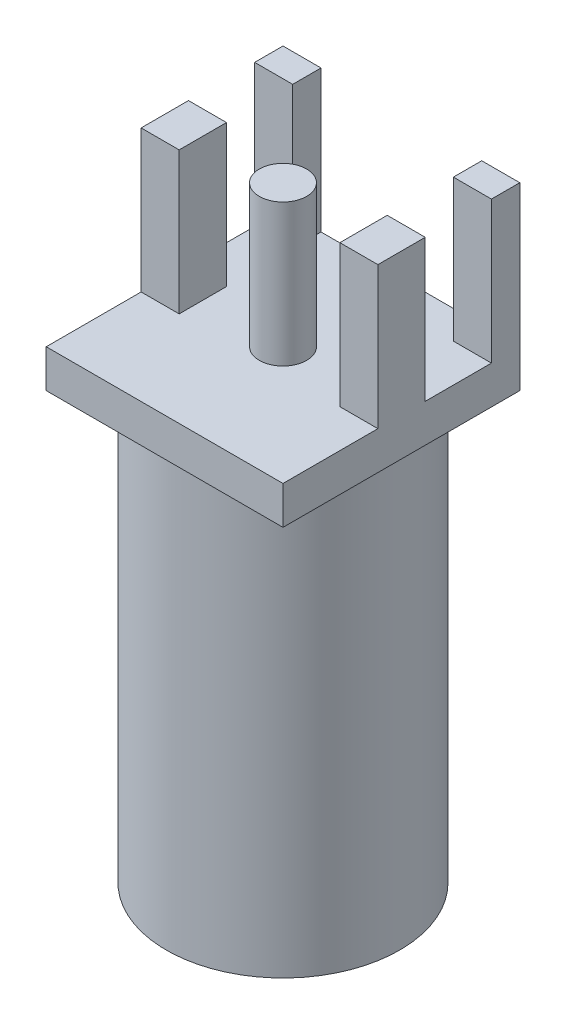
ISO-10303-21;
HEADER;
FILE_DESCRIPTION(('STEP AP214'),'2;1');
FILE_NAME('part.step','',(''),(''),'','','');
FILE_SCHEMA(('AUTOMOTIVE_DESIGN { 1 0 10303 214 1 1 1 1 }'));
ENDSEC;
DATA;
#1=APPLICATION_CONTEXT('core data for automotive mechanical design processes');
#2=APPLICATION_PROTOCOL_DEFINITION('international standard','automotive_design',2000,#1);
#3=PRODUCT_CONTEXT('',#1,'mechanical');
#4=PRODUCT('Part','Part','',(#3));
#5=PRODUCT_RELATED_PRODUCT_CATEGORY('part','',(#4));
#6=PRODUCT_DEFINITION_FORMATION('','',#4);
#7=PRODUCT_DEFINITION_CONTEXT('part definition',#1,'design');
#8=PRODUCT_DEFINITION('design','',#6,#7);
#9=PRODUCT_DEFINITION_SHAPE('','',#8);
#10=(LENGTH_UNIT() NAMED_UNIT(*) SI_UNIT(.MILLI.,.METRE.));
#11=(NAMED_UNIT(*) PLANE_ANGLE_UNIT() SI_UNIT($,.RADIAN.));
#12=(NAMED_UNIT(*) SI_UNIT($,.STERADIAN.) SOLID_ANGLE_UNIT());
#13=UNCERTAINTY_MEASURE_WITH_UNIT(LENGTH_MEASURE(1.E-05),#10,'distance_accuracy_value','');
#14=(GEOMETRIC_REPRESENTATION_CONTEXT(3) GLOBAL_UNCERTAINTY_ASSIGNED_CONTEXT((#13)) GLOBAL_UNIT_ASSIGNED_CONTEXT((#10,
#11,#12)) REPRESENTATION_CONTEXT('',''));
#15=CARTESIAN_POINT('',(0.,0.,0.));
#16=DIRECTION('',(0.,0.,1.));
#17=DIRECTION('',(1.,0.,0.));
#18=AXIS2_PLACEMENT_3D('',#15,#16,#17);
#19=CARTESIAN_POINT('',(0.,1.02,0.));
#20=DIRECTION('',(0.,1.,0.));
#21=DIRECTION('',(0.,0.,1.));
#22=AXIS2_PLACEMENT_3D('',#19,#20,#21);
#23=PLANE('',#22);
#24=CARTESIAN_POINT('',(0.,1.02,0.));
#25=DIRECTION('',(0.,1.,0.));
#26=DIRECTION('',(0.,0.,1.));
#27=AXIS2_PLACEMENT_3D('',#24,#25,#26);
#28=CIRCLE('',#27,0.635);
#29=CARTESIAN_POINT('',(0.,1.02,0.635));
#30=VERTEX_POINT('',#29);
#31=EDGE_CURVE('E538',#30,#30,#28,.T.);
#32=ORIENTED_EDGE('',*,*,#31,.F.);
#33=EDGE_LOOP('',(#32));
#34=FACE_BOUND('',#33,.T.);
#35=DIRECTION('',(1.,0.,0.));
#36=VECTOR('',#35,1.);
#37=CARTESIAN_POINT('',(3.175,1.02,-2.415));
#38=LINE('',#37,#36);
#39=CARTESIAN_POINT('',(2.155,1.02,-2.415));
#40=VERTEX_POINT('',#39);
#41=CARTESIAN_POINT('',(3.175,1.02,-2.415));
#42=VERTEX_POINT('',#41);
#43=EDGE_CURVE('E49',#40,#42,#38,.T.);
#44=ORIENTED_EDGE('',*,*,#43,.F.);
#45=DIRECTION('',(0.,0.,1.));
#46=VECTOR('',#45,1.);
#47=CARTESIAN_POINT('',(2.155,1.02,-3.175));
#48=LINE('',#47,#46);
#49=CARTESIAN_POINT('',(2.155,1.02,-3.175));
#50=VERTEX_POINT('',#49);
#51=EDGE_CURVE('E545',#50,#40,#48,.T.);
#52=ORIENTED_EDGE('',*,*,#51,.F.);
#53=DIRECTION('',(-1.,0.,0.));
#54=VECTOR('',#53,1.);
#55=CARTESIAN_POINT('',(-3.175,1.02,-3.175));
#56=LINE('',#55,#54);
#57=CARTESIAN_POINT('',(-2.155,1.02,-3.175));
#58=VERTEX_POINT('',#57);
#59=EDGE_CURVE('E180',#50,#58,#56,.T.);
#60=ORIENTED_EDGE('',*,*,#59,.T.);
#61=DIRECTION('',(0.,0.,-1.));
#62=VECTOR('',#61,1.);
#63=CARTESIAN_POINT('',(-2.155,1.02,-3.175));
#64=LINE('',#63,#62);
#65=CARTESIAN_POINT('',(-2.155,1.02,-2.415));
#66=VERTEX_POINT('',#65);
#67=EDGE_CURVE('E247',#66,#58,#64,.T.);
#68=ORIENTED_EDGE('',*,*,#67,.F.);
#69=DIRECTION('',(1.,0.,0.));
#70=VECTOR('',#69,1.);
#71=CARTESIAN_POINT('',(-3.175,1.02,-2.415));
#72=LINE('',#71,#70);
#73=CARTESIAN_POINT('',(-3.175,1.02,-2.415));
#74=VERTEX_POINT('',#73);
#75=EDGE_CURVE('E242',#74,#66,#72,.T.);
#76=ORIENTED_EDGE('',*,*,#75,.F.);
#77=DIRECTION('',(0.,0.,1.));
#78=VECTOR('',#77,1.);
#79=CARTESIAN_POINT('',(-3.175,1.02,-3.175));
#80=LINE('',#79,#78);
#81=CARTESIAN_POINT('',(-3.175,1.02,-0.64));
#82=VERTEX_POINT('',#81);
#83=EDGE_CURVE('E271',#74,#82,#80,.T.);
#84=ORIENTED_EDGE('',*,*,#83,.T.);
#85=DIRECTION('',(-1.,0.,0.));
#86=VECTOR('',#85,1.);
#87=CARTESIAN_POINT('',(-3.175,1.02,-0.64));
#88=LINE('',#87,#86);
#89=CARTESIAN_POINT('',(-2.155,1.02,-0.64));
#90=VERTEX_POINT('',#89);
#91=EDGE_CURVE('E221',#90,#82,#88,.T.);
#92=ORIENTED_EDGE('',*,*,#91,.F.);
#93=DIRECTION('',(0.,0.,-1.));
#94=VECTOR('',#93,1.);
#95=CARTESIAN_POINT('',(-2.155,1.02,-0.64));
#96=LINE('',#95,#94);
#97=CARTESIAN_POINT('',(-2.155,1.02,0.63));
#98=VERTEX_POINT('',#97);
#99=EDGE_CURVE('E229',#98,#90,#96,.T.);
#100=ORIENTED_EDGE('',*,*,#99,.F.);
#101=DIRECTION('',(1.,0.,0.));
#102=VECTOR('',#101,1.);
#103=CARTESIAN_POINT('',(-3.175,1.02,0.63));
#104=LINE('',#103,#102);
#105=CARTESIAN_POINT('',(-3.175,1.02,0.63));
#106=VERTEX_POINT('',#105);
#107=EDGE_CURVE('E216',#106,#98,#104,.T.);
#108=ORIENTED_EDGE('',*,*,#107,.F.);
#109=CARTESIAN_POINT('',(-3.175,1.02,3.175));
#110=VERTEX_POINT('',#109);
#111=EDGE_CURVE('E270',#106,#110,#80,.T.);
#112=ORIENTED_EDGE('',*,*,#111,.T.);
#113=DIRECTION('',(1.,0.,0.));
#114=VECTOR('',#113,1.);
#115=CARTESIAN_POINT('',(-3.175,1.02,3.175));
#116=LINE('',#115,#114);
#117=CARTESIAN_POINT('',(3.175,1.02,3.175));
#118=VERTEX_POINT('',#117);
#119=EDGE_CURVE('E274',#110,#118,#116,.T.);
#120=ORIENTED_EDGE('',*,*,#119,.T.);
#121=DIRECTION('',(0.,0.,-1.));
#122=VECTOR('',#121,1.);
#123=CARTESIAN_POINT('',(3.175,1.02,-3.175));
#124=LINE('',#123,#122);
#125=CARTESIAN_POINT('',(3.175,1.02,0.63));
#126=VERTEX_POINT('',#125);
#127=EDGE_CURVE('E267',#118,#126,#124,.T.);
#128=ORIENTED_EDGE('',*,*,#127,.T.);
#129=DIRECTION('',(1.,0.,0.));
#130=VECTOR('',#129,1.);
#131=CARTESIAN_POINT('',(3.175,1.02,0.63));
#132=LINE('',#131,#130);
#133=CARTESIAN_POINT('',(2.155,1.02,0.63));
#134=VERTEX_POINT('',#133);
#135=EDGE_CURVE('E194',#134,#126,#132,.T.);
#136=ORIENTED_EDGE('',*,*,#135,.F.);
#137=DIRECTION('',(0.,0.,1.));
#138=VECTOR('',#137,1.);
#139=CARTESIAN_POINT('',(2.155,1.02,-0.64));
#140=LINE('',#139,#138);
#141=CARTESIAN_POINT('',(2.155,1.02,-0.64));
#142=VERTEX_POINT('',#141);
#143=EDGE_CURVE('E184',#142,#134,#140,.T.);
#144=ORIENTED_EDGE('',*,*,#143,.F.);
#145=DIRECTION('',(-1.,0.,0.));
#146=VECTOR('',#145,1.);
#147=CARTESIAN_POINT('',(3.175,1.02,-0.639999999999999));
#148=LINE('',#147,#146);
#149=CARTESIAN_POINT('',(3.175,1.02,-0.639999999999999));
#150=VERTEX_POINT('',#149);
#151=EDGE_CURVE('E181',#150,#142,#148,.T.);
#152=ORIENTED_EDGE('',*,*,#151,.F.);
#153=EDGE_CURVE('E54',#150,#42,#124,.T.);
#154=ORIENTED_EDGE('',*,*,#153,.T.);
#155=EDGE_LOOP('',(#44,#52,#60,#68,#76,#84,#92,#100,#108,#112,#120,#128,#136,#144,#152,#154));
#156=FACE_BOUND('',#155,.T.);
#157=ADVANCED_FACE('F33',(#34,#156),#23,.T.);
#158=CARTESIAN_POINT('',(3.175,1.02,-3.175));
#159=DIRECTION('',(-1.,0.,0.));
#160=DIRECTION('',(0.,0.,1.));
#161=AXIS2_PLACEMENT_3D('',#158,#159,#160);
#162=PLANE('',#161);
#163=DIRECTION('',(0.,0.,-1.));
#164=VECTOR('',#163,1.);
#165=CARTESIAN_POINT('',(3.175,0.,-3.175));
#166=LINE('',#165,#164);
#167=CARTESIAN_POINT('',(3.175,0.,3.175));
#168=VERTEX_POINT('',#167);
#169=CARTESIAN_POINT('',(3.175,0.,-3.175));
#170=VERTEX_POINT('',#169);
#171=EDGE_CURVE('E266',#168,#170,#166,.T.);
#172=ORIENTED_EDGE('',*,*,#171,.T.);
#173=DIRECTION('',(0.,-1.,0.));
#174=VECTOR('',#173,1.);
#175=CARTESIAN_POINT('',(3.175,1.02,-3.175));
#176=LINE('',#175,#174);
#177=CARTESIAN_POINT('',(3.175,4.83,-3.175));
#178=VERTEX_POINT('',#177);
#179=EDGE_CURVE('E37',#178,#170,#176,.T.);
#180=ORIENTED_EDGE('',*,*,#179,.F.);
#181=DIRECTION('',(0.,0.,-1.));
#182=VECTOR('',#181,1.);
#183=CARTESIAN_POINT('',(3.175,4.83,-3.175));
#184=LINE('',#183,#182);
#185=CARTESIAN_POINT('',(3.175,4.83,-2.415));
#186=VERTEX_POINT('',#185);
#187=EDGE_CURVE('E174',#186,#178,#184,.T.);
#188=ORIENTED_EDGE('',*,*,#187,.F.);
#189=DIRECTION('',(0.,-1.,0.));
#190=VECTOR('',#189,1.);
#191=CARTESIAN_POINT('',(3.175,4.83,-2.415));
#192=LINE('',#191,#190);
#193=EDGE_CURVE('E186',#186,#42,#192,.T.);
#194=ORIENTED_EDGE('',*,*,#193,.T.);
#195=ORIENTED_EDGE('',*,*,#153,.F.);
#196=DIRECTION('',(0.,-1.,0.));
#197=VECTOR('',#196,1.);
#198=CARTESIAN_POINT('',(3.175,4.83,-0.639999999999999));
#199=LINE('',#198,#197);
#200=CARTESIAN_POINT('',(3.175,4.83,-0.639999999999999));
#201=VERTEX_POINT('',#200);
#202=EDGE_CURVE('E199',#201,#150,#199,.T.);
#203=ORIENTED_EDGE('',*,*,#202,.F.);
#204=DIRECTION('',(0.,0.,-1.));
#205=VECTOR('',#204,1.);
#206=CARTESIAN_POINT('',(3.175,4.83,-0.639999999999999));
#207=LINE('',#206,#205);
#208=CARTESIAN_POINT('',(3.175,4.83,0.63));
#209=VERTEX_POINT('',#208);
#210=EDGE_CURVE('E198',#209,#201,#207,.T.);
#211=ORIENTED_EDGE('',*,*,#210,.F.);
#212=DIRECTION('',(0.,-1.,0.));
#213=VECTOR('',#212,1.);
#214=CARTESIAN_POINT('',(3.175,4.83,0.63));
#215=LINE('',#214,#213);
#216=EDGE_CURVE('E207',#209,#126,#215,.T.);
#217=ORIENTED_EDGE('',*,*,#216,.T.);
#218=ORIENTED_EDGE('',*,*,#127,.F.);
#219=DIRECTION('',(0.,-1.,0.));
#220=VECTOR('',#219,1.);
#221=CARTESIAN_POINT('',(3.175,1.02,3.175));
#222=LINE('',#221,#220);
#223=EDGE_CURVE('E276',#118,#168,#222,.T.);
#224=ORIENTED_EDGE('',*,*,#223,.T.);
#225=EDGE_LOOP('',(#172,#180,#188,#194,#195,#203,#211,#217,#218,#224));
#226=FACE_BOUND('',#225,.T.);
#227=ADVANCED_FACE('F35',(#226),#162,.F.);
#228=CARTESIAN_POINT('',(-3.175,1.02,-3.175));
#229=DIRECTION('',(0.,0.,1.));
#230=DIRECTION('',(1.,0.,0.));
#231=AXIS2_PLACEMENT_3D('',#228,#229,#230);
#232=PLANE('',#231);
#233=DIRECTION('',(-1.,0.,0.));
#234=VECTOR('',#233,1.);
#235=CARTESIAN_POINT('',(-3.175,0.,-3.175));
#236=LINE('',#235,#234);
#237=CARTESIAN_POINT('',(-3.175,0.,-3.175));
#238=VERTEX_POINT('',#237);
#239=EDGE_CURVE('E279',#170,#238,#236,.T.);
#240=ORIENTED_EDGE('',*,*,#239,.T.);
#241=DIRECTION('',(0.,-1.,0.));
#242=VECTOR('',#241,1.);
#243=CARTESIAN_POINT('',(-3.175,1.02,-3.175));
#244=LINE('',#243,#242);
#245=CARTESIAN_POINT('',(-3.175,4.83,-3.175));
#246=VERTEX_POINT('',#245);
#247=EDGE_CURVE('E289',#246,#238,#244,.T.);
#248=ORIENTED_EDGE('',*,*,#247,.F.);
#249=DIRECTION('',(-1.,0.,0.));
#250=VECTOR('',#249,1.);
#251=CARTESIAN_POINT('',(-3.175,4.83,-3.175));
#252=LINE('',#251,#250);
#253=CARTESIAN_POINT('',(-2.155,4.83,-3.175));
#254=VERTEX_POINT('',#253);
#255=EDGE_CURVE('E251',#254,#246,#252,.T.);
#256=ORIENTED_EDGE('',*,*,#255,.F.);
#257=DIRECTION('',(0.,-1.,0.));
#258=VECTOR('',#257,1.);
#259=CARTESIAN_POINT('',(-2.155,4.83,-3.175));
#260=LINE('',#259,#258);
#261=EDGE_CURVE('E254',#254,#58,#260,.T.);
#262=ORIENTED_EDGE('',*,*,#261,.T.);
#263=ORIENTED_EDGE('',*,*,#59,.F.);
#264=DIRECTION('',(0.,-1.,0.));
#265=VECTOR('',#264,1.);
#266=CARTESIAN_POINT('',(2.155,4.83,-3.175));
#267=LINE('',#266,#265);
#268=CARTESIAN_POINT('',(2.155,4.83,-3.175));
#269=VERTEX_POINT('',#268);
#270=EDGE_CURVE('E162',#269,#50,#267,.T.);
#271=ORIENTED_EDGE('',*,*,#270,.F.);
#272=DIRECTION('',(-1.,0.,0.));
#273=VECTOR('',#272,1.);
#274=CARTESIAN_POINT('',(3.175,4.83,-3.175));
#275=LINE('',#274,#273);
#276=EDGE_CURVE('E168',#178,#269,#275,.T.);
#277=ORIENTED_EDGE('',*,*,#276,.F.);
#278=ORIENTED_EDGE('',*,*,#179,.T.);
#279=EDGE_LOOP('',(#240,#248,#256,#262,#263,#271,#277,#278));
#280=FACE_BOUND('',#279,.T.);
#281=ADVANCED_FACE('F178',(#280),#232,.F.);
#282=CARTESIAN_POINT('',(-3.175,1.02,-3.175));
#283=DIRECTION('',(1.,0.,0.));
#284=DIRECTION('',(0.,0.,-1.));
#285=AXIS2_PLACEMENT_3D('',#282,#283,#284);
#286=PLANE('',#285);
#287=DIRECTION('',(0.,0.,1.));
#288=VECTOR('',#287,1.);
#289=CARTESIAN_POINT('',(-3.175,0.,-3.175));
#290=LINE('',#289,#288);
#291=CARTESIAN_POINT('',(-3.175,0.,3.175));
#292=VERTEX_POINT('',#291);
#293=EDGE_CURVE('E281',#238,#292,#290,.T.);
#294=ORIENTED_EDGE('',*,*,#293,.T.);
#295=DIRECTION('',(0.,-1.,0.));
#296=VECTOR('',#295,1.);
#297=CARTESIAN_POINT('',(-3.175,1.02,3.175));
#298=LINE('',#297,#296);
#299=EDGE_CURVE('E287',#110,#292,#298,.T.);
#300=ORIENTED_EDGE('',*,*,#299,.F.);
#301=ORIENTED_EDGE('',*,*,#111,.F.);
#302=DIRECTION('',(0.,-1.,0.));
#303=VECTOR('',#302,1.);
#304=CARTESIAN_POINT('',(-3.175,4.83,0.63));
#305=LINE('',#304,#303);
#306=CARTESIAN_POINT('',(-3.175,4.83,0.63));
#307=VERTEX_POINT('',#306);
#308=EDGE_CURVE('E240',#307,#106,#305,.T.);
#309=ORIENTED_EDGE('',*,*,#308,.F.);
#310=DIRECTION('',(0.,0.,1.));
#311=VECTOR('',#310,1.);
#312=CARTESIAN_POINT('',(-3.175,4.83,-0.64));
#313=LINE('',#312,#311);
#314=CARTESIAN_POINT('',(-3.175,4.83,-0.64));
#315=VERTEX_POINT('',#314);
#316=EDGE_CURVE('E217',#315,#307,#313,.T.);
#317=ORIENTED_EDGE('',*,*,#316,.F.);
#318=DIRECTION('',(0.,-1.,0.));
#319=VECTOR('',#318,1.);
#320=CARTESIAN_POINT('',(-3.175,4.83,-0.64));
#321=LINE('',#320,#319);
#322=EDGE_CURVE('E227',#315,#82,#321,.T.);
#323=ORIENTED_EDGE('',*,*,#322,.T.);
#324=ORIENTED_EDGE('',*,*,#83,.F.);
#325=DIRECTION('',(0.,-1.,0.));
#326=VECTOR('',#325,1.);
#327=CARTESIAN_POINT('',(-3.175,4.83,-2.415));
#328=LINE('',#327,#326);
#329=CARTESIAN_POINT('',(-3.175,4.83,-2.415));
#330=VERTEX_POINT('',#329);
#331=EDGE_CURVE('E263',#330,#74,#328,.T.);
#332=ORIENTED_EDGE('',*,*,#331,.F.);
#333=DIRECTION('',(0.,0.,1.));
#334=VECTOR('',#333,1.);
#335=CARTESIAN_POINT('',(-3.175,4.83,-3.175));
#336=LINE('',#335,#334);
#337=EDGE_CURVE('E243',#246,#330,#336,.T.);
#338=ORIENTED_EDGE('',*,*,#337,.F.);
#339=ORIENTED_EDGE('',*,*,#247,.T.);
#340=EDGE_LOOP('',(#294,#300,#301,#309,#317,#323,#324,#332,#338,#339));
#341=FACE_BOUND('',#340,.T.);
#342=ADVANCED_FACE('F302',(#341),#286,.F.);
#343=CARTESIAN_POINT('',(-3.175,1.02,3.175));
#344=DIRECTION('',(0.,0.,-1.));
#345=DIRECTION('',(-1.,0.,0.));
#346=AXIS2_PLACEMENT_3D('',#343,#344,#345);
#347=PLANE('',#346);
#348=DIRECTION('',(1.,0.,0.));
#349=VECTOR('',#348,1.);
#350=CARTESIAN_POINT('',(-3.175,0.,3.175));
#351=LINE('',#350,#349);
#352=EDGE_CURVE('E283',#292,#168,#351,.T.);
#353=ORIENTED_EDGE('',*,*,#352,.T.);
#354=ORIENTED_EDGE('',*,*,#223,.F.);
#355=ORIENTED_EDGE('',*,*,#119,.F.);
#356=ORIENTED_EDGE('',*,*,#299,.T.);
#357=EDGE_LOOP('',(#353,#354,#355,#356));
#358=FACE_BOUND('',#357,.T.);
#359=ADVANCED_FACE('F306',(#358),#347,.F.);
#360=CARTESIAN_POINT('',(0.,0.,0.));
#361=DIRECTION('',(0.,1.,0.));
#362=DIRECTION('',(0.,0.,1.));
#363=AXIS2_PLACEMENT_3D('',#360,#361,#362);
#364=PLANE('',#363);
#365=CARTESIAN_POINT('',(0.,0.,0.));
#366=DIRECTION('',(0.,-1.,0.));
#367=DIRECTION('',(0.,0.,-1.));
#368=AXIS2_PLACEMENT_3D('',#365,#366,#367);
#369=CIRCLE('',#368,3.13);
#370=CARTESIAN_POINT('',(0.,0.,-3.13));
#371=VERTEX_POINT('',#370);
#372=EDGE_CURVE('E11',#371,#371,#369,.T.);
#373=ORIENTED_EDGE('',*,*,#372,.F.);
#374=EDGE_LOOP('',(#373));
#375=FACE_BOUND('',#374,.T.);
#376=ORIENTED_EDGE('',*,*,#171,.F.);
#377=ORIENTED_EDGE('',*,*,#352,.F.);
#378=ORIENTED_EDGE('',*,*,#293,.F.);
#379=ORIENTED_EDGE('',*,*,#239,.F.);
#380=EDGE_LOOP('',(#376,#377,#378,#379));
#381=FACE_BOUND('',#380,.T.);
#382=ADVANCED_FACE('F300',(#375,#381),#364,.F.);
#383=CARTESIAN_POINT('',(-3.175,4.83,-2.415));
#384=DIRECTION('',(0.,0.,-1.));
#385=DIRECTION('',(-1.,0.,0.));
#386=AXIS2_PLACEMENT_3D('',#383,#384,#385);
#387=PLANE('',#386);
#388=ORIENTED_EDGE('',*,*,#75,.T.);
#389=DIRECTION('',(0.,-1.,0.));
#390=VECTOR('',#389,1.);
#391=CARTESIAN_POINT('',(-2.155,4.83,-2.415));
#392=LINE('',#391,#390);
#393=CARTESIAN_POINT('',(-2.155,4.83,-2.415));
#394=VERTEX_POINT('',#393);
#395=EDGE_CURVE('E260',#394,#66,#392,.T.);
#396=ORIENTED_EDGE('',*,*,#395,.F.);
#397=DIRECTION('',(1.,0.,0.));
#398=VECTOR('',#397,1.);
#399=CARTESIAN_POINT('',(-3.175,4.83,-2.415));
#400=LINE('',#399,#398);
#401=EDGE_CURVE('E246',#330,#394,#400,.T.);
#402=ORIENTED_EDGE('',*,*,#401,.F.);
#403=ORIENTED_EDGE('',*,*,#331,.T.);
#404=EDGE_LOOP('',(#388,#396,#402,#403));
#405=FACE_BOUND('',#404,.T.);
#406=ADVANCED_FACE('F327',(#405),#387,.F.);
#407=CARTESIAN_POINT('',(-2.155,4.83,-3.175));
#408=DIRECTION('',(-1.,0.,0.));
#409=DIRECTION('',(0.,0.,1.));
#410=AXIS2_PLACEMENT_3D('',#407,#408,#409);
#411=PLANE('',#410);
#412=ORIENTED_EDGE('',*,*,#67,.T.);
#413=ORIENTED_EDGE('',*,*,#261,.F.);
#414=DIRECTION('',(0.,0.,-1.));
#415=VECTOR('',#414,1.);
#416=CARTESIAN_POINT('',(-2.155,4.83,-3.175));
#417=LINE('',#416,#415);
#418=EDGE_CURVE('E249',#394,#254,#417,.T.);
#419=ORIENTED_EDGE('',*,*,#418,.F.);
#420=ORIENTED_EDGE('',*,*,#395,.T.);
#421=EDGE_LOOP('',(#412,#413,#419,#420));
#422=FACE_BOUND('',#421,.T.);
#423=ADVANCED_FACE('F330',(#422),#411,.F.);
#424=CARTESIAN_POINT('',(0.,4.83,0.));
#425=DIRECTION('',(0.,1.,0.));
#426=DIRECTION('',(0.,0.,1.));
#427=AXIS2_PLACEMENT_3D('',#424,#425,#426);
#428=PLANE('',#427);
#429=ORIENTED_EDGE('',*,*,#337,.T.);
#430=ORIENTED_EDGE('',*,*,#401,.T.);
#431=ORIENTED_EDGE('',*,*,#418,.T.);
#432=ORIENTED_EDGE('',*,*,#255,.T.);
#433=EDGE_LOOP('',(#429,#430,#431,#432));
#434=FACE_BOUND('',#433,.T.);
#435=ADVANCED_FACE('F334',(#434),#428,.T.);
#436=CARTESIAN_POINT('',(-3.175,4.83,0.63));
#437=DIRECTION('',(0.,0.,-1.));
#438=DIRECTION('',(-1.,0.,0.));
#439=AXIS2_PLACEMENT_3D('',#436,#437,#438);
#440=PLANE('',#439);
#441=ORIENTED_EDGE('',*,*,#107,.T.);
#442=DIRECTION('',(0.,-1.,0.));
#443=VECTOR('',#442,1.);
#444=CARTESIAN_POINT('',(-2.155,4.83,0.63));
#445=LINE('',#444,#443);
#446=CARTESIAN_POINT('',(-2.155,4.83,0.63));
#447=VERTEX_POINT('',#446);
#448=EDGE_CURVE('E237',#447,#98,#445,.T.);
#449=ORIENTED_EDGE('',*,*,#448,.F.);
#450=DIRECTION('',(1.,0.,0.));
#451=VECTOR('',#450,1.);
#452=CARTESIAN_POINT('',(-3.175,4.83,0.63));
#453=LINE('',#452,#451);
#454=EDGE_CURVE('E220',#307,#447,#453,.T.);
#455=ORIENTED_EDGE('',*,*,#454,.F.);
#456=ORIENTED_EDGE('',*,*,#308,.T.);
#457=EDGE_LOOP('',(#441,#449,#455,#456));
#458=FACE_BOUND('',#457,.T.);
#459=ADVANCED_FACE('F312',(#458),#440,.F.);
#460=CARTESIAN_POINT('',(-2.155,4.83,-0.64));
#461=DIRECTION('',(-1.,0.,0.));
#462=DIRECTION('',(0.,0.,1.));
#463=AXIS2_PLACEMENT_3D('',#460,#461,#462);
#464=PLANE('',#463);
#465=ORIENTED_EDGE('',*,*,#99,.T.);
#466=DIRECTION('',(0.,-1.,0.));
#467=VECTOR('',#466,1.);
#468=CARTESIAN_POINT('',(-2.155,4.83,-0.64));
#469=LINE('',#468,#467);
#470=CARTESIAN_POINT('',(-2.155,4.83,-0.64));
#471=VERTEX_POINT('',#470);
#472=EDGE_CURVE('E235',#471,#90,#469,.T.);
#473=ORIENTED_EDGE('',*,*,#472,.F.);
#474=DIRECTION('',(0.,0.,-1.));
#475=VECTOR('',#474,1.);
#476=CARTESIAN_POINT('',(-2.155,4.83,-0.64));
#477=LINE('',#476,#475);
#478=EDGE_CURVE('E223',#447,#471,#477,.T.);
#479=ORIENTED_EDGE('',*,*,#478,.F.);
#480=ORIENTED_EDGE('',*,*,#448,.T.);
#481=EDGE_LOOP('',(#465,#473,#479,#480));
#482=FACE_BOUND('',#481,.T.);
#483=ADVANCED_FACE('F341',(#482),#464,.F.);
#484=CARTESIAN_POINT('',(-3.175,4.83,-0.64));
#485=DIRECTION('',(0.,0.,1.));
#486=DIRECTION('',(1.,0.,0.));
#487=AXIS2_PLACEMENT_3D('',#484,#485,#486);
#488=PLANE('',#487);
#489=ORIENTED_EDGE('',*,*,#91,.T.);
#490=ORIENTED_EDGE('',*,*,#322,.F.);
#491=DIRECTION('',(-1.,0.,0.));
#492=VECTOR('',#491,1.);
#493=CARTESIAN_POINT('',(-3.175,4.83,-0.64));
#494=LINE('',#493,#492);
#495=EDGE_CURVE('E225',#471,#315,#494,.T.);
#496=ORIENTED_EDGE('',*,*,#495,.F.);
#497=ORIENTED_EDGE('',*,*,#472,.T.);
#498=EDGE_LOOP('',(#489,#490,#496,#497));
#499=FACE_BOUND('',#498,.T.);
#500=ADVANCED_FACE('F321',(#499),#488,.F.);
#501=CARTESIAN_POINT('',(0.,4.83,0.));
#502=DIRECTION('',(0.,1.,0.));
#503=DIRECTION('',(0.,0.,1.));
#504=AXIS2_PLACEMENT_3D('',#501,#502,#503);
#505=PLANE('',#504);
#506=ORIENTED_EDGE('',*,*,#316,.T.);
#507=ORIENTED_EDGE('',*,*,#454,.T.);
#508=ORIENTED_EDGE('',*,*,#478,.T.);
#509=ORIENTED_EDGE('',*,*,#495,.T.);
#510=EDGE_LOOP('',(#506,#507,#508,#509));
#511=FACE_BOUND('',#510,.T.);
#512=ADVANCED_FACE('F316',(#511),#505,.T.);
#513=CARTESIAN_POINT('',(3.175,4.83,-0.639999999999999));
#514=DIRECTION('',(0.,0.,1.));
#515=DIRECTION('',(1.,0.,0.));
#516=AXIS2_PLACEMENT_3D('',#513,#514,#515);
#517=PLANE('',#516);
#518=ORIENTED_EDGE('',*,*,#151,.T.);
#519=DIRECTION('',(0.,-1.,0.));
#520=VECTOR('',#519,1.);
#521=CARTESIAN_POINT('',(2.155,4.83,-0.64));
#522=LINE('',#521,#520);
#523=CARTESIAN_POINT('',(2.155,4.83,-0.64));
#524=VERTEX_POINT('',#523);
#525=EDGE_CURVE('E213',#524,#142,#522,.T.);
#526=ORIENTED_EDGE('',*,*,#525,.F.);
#527=DIRECTION('',(-1.,0.,0.));
#528=VECTOR('',#527,1.);
#529=CARTESIAN_POINT('',(3.175,4.83,-0.639999999999999));
#530=LINE('',#529,#528);
#531=EDGE_CURVE('E190',#201,#524,#530,.T.);
#532=ORIENTED_EDGE('',*,*,#531,.F.);
#533=ORIENTED_EDGE('',*,*,#202,.T.);
#534=EDGE_LOOP('',(#518,#526,#532,#533));
#535=FACE_BOUND('',#534,.T.);
#536=ADVANCED_FACE('F423',(#535),#517,.F.);
#537=CARTESIAN_POINT('',(2.155,4.83,-0.64));
#538=DIRECTION('',(1.,0.,0.));
#539=DIRECTION('',(0.,0.,-1.));
#540=AXIS2_PLACEMENT_3D('',#537,#538,#539);
#541=PLANE('',#540);
#542=ORIENTED_EDGE('',*,*,#143,.T.);
#543=DIRECTION('',(0.,-1.,0.));
#544=VECTOR('',#543,1.);
#545=CARTESIAN_POINT('',(2.155,4.83,0.63));
#546=LINE('',#545,#544);
#547=CARTESIAN_POINT('',(2.155,4.83,0.63));
#548=VERTEX_POINT('',#547);
#549=EDGE_CURVE('E210',#548,#134,#546,.T.);
#550=ORIENTED_EDGE('',*,*,#549,.F.);
#551=DIRECTION('',(0.,0.,1.));
#552=VECTOR('',#551,1.);
#553=CARTESIAN_POINT('',(2.155,4.83,-0.64));
#554=LINE('',#553,#552);
#555=EDGE_CURVE('E193',#524,#548,#554,.T.);
#556=ORIENTED_EDGE('',*,*,#555,.F.);
#557=ORIENTED_EDGE('',*,*,#525,.T.);
#558=EDGE_LOOP('',(#542,#550,#556,#557));
#559=FACE_BOUND('',#558,.T.);
#560=ADVANCED_FACE('F432',(#559),#541,.F.);
#561=CARTESIAN_POINT('',(3.175,4.83,0.63));
#562=DIRECTION('',(0.,0.,-1.));
#563=DIRECTION('',(-1.,0.,0.));
#564=AXIS2_PLACEMENT_3D('',#561,#562,#563);
#565=PLANE('',#564);
#566=ORIENTED_EDGE('',*,*,#135,.T.);
#567=ORIENTED_EDGE('',*,*,#216,.F.);
#568=DIRECTION('',(1.,0.,0.));
#569=VECTOR('',#568,1.);
#570=CARTESIAN_POINT('',(3.175,4.83,0.63));
#571=LINE('',#570,#569);
#572=EDGE_CURVE('E196',#548,#209,#571,.T.);
#573=ORIENTED_EDGE('',*,*,#572,.F.);
#574=ORIENTED_EDGE('',*,*,#549,.T.);
#575=EDGE_LOOP('',(#566,#567,#573,#574));
#576=FACE_BOUND('',#575,.T.);
#577=ADVANCED_FACE('F442',(#576),#565,.F.);
#578=CARTESIAN_POINT('',(0.,4.83,0.));
#579=DIRECTION('',(0.,1.,0.));
#580=DIRECTION('',(0.,0.,1.));
#581=AXIS2_PLACEMENT_3D('',#578,#579,#580);
#582=PLANE('',#581);
#583=ORIENTED_EDGE('',*,*,#531,.T.);
#584=ORIENTED_EDGE('',*,*,#555,.T.);
#585=ORIENTED_EDGE('',*,*,#572,.T.);
#586=ORIENTED_EDGE('',*,*,#210,.T.);
#587=EDGE_LOOP('',(#583,#584,#585,#586));
#588=FACE_BOUND('',#587,.T.);
#589=ADVANCED_FACE('F452',(#588),#582,.T.);
#590=CARTESIAN_POINT('',(2.155,4.83,-3.175));
#591=DIRECTION('',(1.,0.,0.));
#592=DIRECTION('',(0.,0.,-1.));
#593=AXIS2_PLACEMENT_3D('',#590,#591,#592);
#594=PLANE('',#593);
#595=ORIENTED_EDGE('',*,*,#51,.T.);
#596=DIRECTION('',(0.,-1.,0.));
#597=VECTOR('',#596,1.);
#598=CARTESIAN_POINT('',(2.155,4.83,-2.415));
#599=LINE('',#598,#597);
#600=CARTESIAN_POINT('',(2.155,4.83,-2.415));
#601=VERTEX_POINT('',#600);
#602=EDGE_CURVE('E164',#601,#40,#599,.T.);
#603=ORIENTED_EDGE('',*,*,#602,.F.);
#604=DIRECTION('',(0.,0.,1.));
#605=VECTOR('',#604,1.);
#606=CARTESIAN_POINT('',(2.155,4.83,-3.175));
#607=LINE('',#606,#605);
#608=EDGE_CURVE('E158',#269,#601,#607,.T.);
#609=ORIENTED_EDGE('',*,*,#608,.F.);
#610=ORIENTED_EDGE('',*,*,#270,.T.);
#611=EDGE_LOOP('',(#595,#603,#609,#610));
#612=FACE_BOUND('',#611,.T.);
#613=ADVANCED_FACE('F160',(#612),#594,.F.);
#614=CARTESIAN_POINT('',(3.175,4.83,-2.415));
#615=DIRECTION('',(0.,0.,-1.));
#616=DIRECTION('',(-1.,0.,0.));
#617=AXIS2_PLACEMENT_3D('',#614,#615,#616);
#618=PLANE('',#617);
#619=ORIENTED_EDGE('',*,*,#43,.T.);
#620=ORIENTED_EDGE('',*,*,#193,.F.);
#621=DIRECTION('',(1.,0.,0.));
#622=VECTOR('',#621,1.);
#623=CARTESIAN_POINT('',(3.175,4.83,-2.415));
#624=LINE('',#623,#622);
#625=EDGE_CURVE('E167',#601,#186,#624,.T.);
#626=ORIENTED_EDGE('',*,*,#625,.F.);
#627=ORIENTED_EDGE('',*,*,#602,.T.);
#628=EDGE_LOOP('',(#619,#620,#626,#627));
#629=FACE_BOUND('',#628,.T.);
#630=ADVANCED_FACE('F471',(#629),#618,.F.);
#631=CARTESIAN_POINT('',(0.,4.83,0.));
#632=DIRECTION('',(0.,1.,0.));
#633=DIRECTION('',(0.,0.,1.));
#634=AXIS2_PLACEMENT_3D('',#631,#632,#633);
#635=PLANE('',#634);
#636=ORIENTED_EDGE('',*,*,#276,.T.);
#637=ORIENTED_EDGE('',*,*,#608,.T.);
#638=ORIENTED_EDGE('',*,*,#625,.T.);
#639=ORIENTED_EDGE('',*,*,#187,.T.);
#640=EDGE_LOOP('',(#636,#637,#638,#639));
#641=FACE_BOUND('',#640,.T.);
#642=ADVANCED_FACE('F172',(#641),#635,.T.);
#643=CARTESIAN_POINT('',(0.,4.83,0.));
#644=DIRECTION('',(0.,-1.,0.));
#645=DIRECTION('',(0.,0.,-1.));
#646=AXIS2_PLACEMENT_3D('',#643,#644,#645);
#647=CYLINDRICAL_SURFACE('',#646,0.635);
#648=CARTESIAN_POINT('',(0.,4.83,0.));
#649=DIRECTION('',(0.,1.,0.));
#650=DIRECTION('',(0.,0.,1.));
#651=AXIS2_PLACEMENT_3D('',#648,#649,#650);
#652=CIRCLE('',#651,0.635);
#653=CARTESIAN_POINT('',(0.,4.83,0.635));
#654=VERTEX_POINT('',#653);
#655=EDGE_CURVE('E541',#654,#654,#652,.T.);
#656=ORIENTED_EDGE('',*,*,#655,.F.);
#657=EDGE_LOOP('',(#656));
#658=FACE_BOUND('',#657,.T.);
#659=ORIENTED_EDGE('',*,*,#31,.T.);
#660=EDGE_LOOP('',(#659));
#661=FACE_BOUND('',#660,.T.);
#662=ADVANCED_FACE('F488',(#658,#661),#647,.T.);
#663=CARTESIAN_POINT('',(0.,4.83,0.));
#664=DIRECTION('',(0.,1.,0.));
#665=DIRECTION('',(0.,0.,1.));
#666=AXIS2_PLACEMENT_3D('',#663,#664,#665);
#667=PLANE('',#666);
#668=ORIENTED_EDGE('',*,*,#655,.T.);
#669=EDGE_LOOP('',(#668));
#670=FACE_BOUND('',#669,.T.);
#671=ADVANCED_FACE('F502',(#670),#667,.T.);
#672=CARTESIAN_POINT('',(0.,-11.43,0.));
#673=DIRECTION('',(0.,1.,0.));
#674=DIRECTION('',(0.,0.,1.));
#675=AXIS2_PLACEMENT_3D('',#672,#673,#674);
#676=CYLINDRICAL_SURFACE('',#675,3.13);
#677=CARTESIAN_POINT('',(0.,-11.43,0.));
#678=DIRECTION('',(0.,-1.,0.));
#679=DIRECTION('',(0.,0.,-1.));
#680=AXIS2_PLACEMENT_3D('',#677,#678,#679);
#681=CIRCLE('',#680,3.13);
#682=CARTESIAN_POINT('',(0.,-11.43,-3.13));
#683=VERTEX_POINT('',#682);
#684=EDGE_CURVE('E537',#683,#683,#681,.T.);
#685=ORIENTED_EDGE('',*,*,#684,.F.);
#686=EDGE_LOOP('',(#685));
#687=FACE_BOUND('',#686,.T.);
#688=ORIENTED_EDGE('',*,*,#372,.T.);
#689=EDGE_LOOP('',(#688));
#690=FACE_BOUND('',#689,.T.);
#691=ADVANCED_FACE('F511',(#687,#690),#676,.T.);
#692=CARTESIAN_POINT('',(0.,-11.43,0.));
#693=DIRECTION('',(0.,-1.,0.));
#694=DIRECTION('',(0.,0.,-1.));
#695=AXIS2_PLACEMENT_3D('',#692,#693,#694);
#696=PLANE('',#695);
#697=ORIENTED_EDGE('',*,*,#684,.T.);
#698=EDGE_LOOP('',(#697));
#699=FACE_BOUND('',#698,.T.);
#700=ADVANCED_FACE('F521',(#699),#696,.T.);
#701=CLOSED_SHELL('',(#157,#227,#281,#342,#359,#382,#406,#423,#435,#459,#483,#500,#512,#536,
#560,#577,#589,#613,#630,#642,#662,#671,#691,#700));
#702=MANIFOLD_SOLID_BREP('B2',#701);
#703=ADVANCED_BREP_SHAPE_REPRESENTATION('',(#18,#702),#14);
#704=SHAPE_DEFINITION_REPRESENTATION(#9,#703);
ENDSEC;
END-ISO-10303-21;
